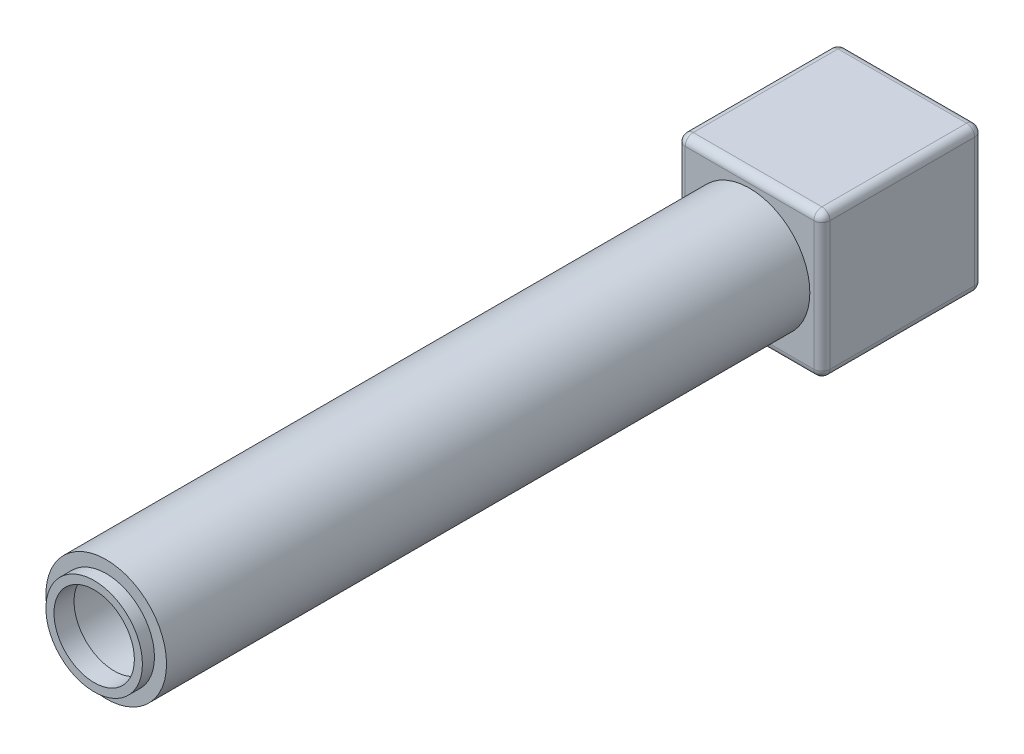
ISO-10303-21;
HEADER;
FILE_DESCRIPTION(('STEP AP214'),'2;1');
FILE_NAME('part.step','',(''),(''),'','','');
FILE_SCHEMA(('AUTOMOTIVE_DESIGN { 1 0 10303 214 1 1 1 1 }'));
ENDSEC;
DATA;
#1=APPLICATION_CONTEXT('core data for automotive mechanical design processes');
#2=APPLICATION_PROTOCOL_DEFINITION('international standard','automotive_design',2000,#1);
#3=PRODUCT_CONTEXT('',#1,'mechanical');
#4=PRODUCT('Part','Part','',(#3));
#5=PRODUCT_RELATED_PRODUCT_CATEGORY('part','',(#4));
#6=PRODUCT_DEFINITION_FORMATION('','',#4);
#7=PRODUCT_DEFINITION_CONTEXT('part definition',#1,'design');
#8=PRODUCT_DEFINITION('design','',#6,#7);
#9=PRODUCT_DEFINITION_SHAPE('','',#8);
#10=(LENGTH_UNIT() NAMED_UNIT(*) SI_UNIT(.MILLI.,.METRE.));
#11=(NAMED_UNIT(*) PLANE_ANGLE_UNIT() SI_UNIT($,.RADIAN.));
#12=(NAMED_UNIT(*) SI_UNIT($,.STERADIAN.) SOLID_ANGLE_UNIT());
#13=UNCERTAINTY_MEASURE_WITH_UNIT(LENGTH_MEASURE(1.E-05),#10,'distance_accuracy_value','');
#14=(GEOMETRIC_REPRESENTATION_CONTEXT(3) GLOBAL_UNCERTAINTY_ASSIGNED_CONTEXT((#13)) GLOBAL_UNIT_ASSIGNED_CONTEXT((#10,
#11,#12)) REPRESENTATION_CONTEXT('',''));
#15=CARTESIAN_POINT('',(0.,0.,0.));
#16=DIRECTION('',(0.,0.,1.));
#17=DIRECTION('',(1.,0.,0.));
#18=AXIS2_PLACEMENT_3D('',#15,#16,#17);
#19=CARTESIAN_POINT('',(0.,0.,79.));
#20=DIRECTION('',(0.,0.,1.));
#21=DIRECTION('',(1.,0.,0.));
#22=AXIS2_PLACEMENT_3D('',#19,#20,#21);
#23=CYLINDRICAL_SURFACE('',#22,6.);
#24=CARTESIAN_POINT('',(0.,0.,79.));
#25=DIRECTION('',(0.,0.,1.));
#26=DIRECTION('',(1.,0.,0.));
#27=AXIS2_PLACEMENT_3D('',#24,#25,#26);
#28=CIRCLE('',#27,6.);
#29=CARTESIAN_POINT('',(6.,0.,79.));
#30=VERTEX_POINT('',#29);
#31=EDGE_CURVE('E11',#30,#30,#28,.T.);
#32=ORIENTED_EDGE('',*,*,#31,.T.);
#33=EDGE_LOOP('',(#32));
#34=FACE_BOUND('',#33,.T.);
#35=CARTESIAN_POINT('',(0.,0.,81.5));
#36=DIRECTION('',(0.,0.,1.));
#37=DIRECTION('',(1.,0.,0.));
#38=AXIS2_PLACEMENT_3D('',#35,#36,#37);
#39=CIRCLE('',#38,6.);
#40=CARTESIAN_POINT('',(6.,0.,81.5));
#41=VERTEX_POINT('',#40);
#42=EDGE_CURVE('E58',#41,#41,#39,.T.);
#43=ORIENTED_EDGE('',*,*,#42,.F.);
#44=EDGE_LOOP('',(#43));
#45=FACE_BOUND('',#44,.T.);
#46=ADVANCED_FACE('F48',(#34,#45),#23,.T.);
#47=CARTESIAN_POINT('',(0.,0.,79.));
#48=DIRECTION('',(0.,0.,1.));
#49=DIRECTION('',(1.,0.,0.));
#50=AXIS2_PLACEMENT_3D('',#47,#48,#49);
#51=PLANE('',#50);
#52=CARTESIAN_POINT('',(0.,0.,79.));
#53=DIRECTION('',(0.,0.,1.));
#54=DIRECTION('',(1.,0.,0.));
#55=AXIS2_PLACEMENT_3D('',#52,#53,#54);
#56=CIRCLE('',#55,5.);
#57=CARTESIAN_POINT('',(5.,0.,79.));
#58=VERTEX_POINT('',#57);
#59=EDGE_CURVE('E54',#58,#58,#56,.T.);
#60=ORIENTED_EDGE('',*,*,#59,.T.);
#61=EDGE_LOOP('',(#60));
#62=FACE_BOUND('',#61,.T.);
#63=ORIENTED_EDGE('',*,*,#31,.F.);
#64=EDGE_LOOP('',(#63));
#65=FACE_BOUND('',#64,.T.);
#66=ADVANCED_FACE('F77',(#62,#65),#51,.F.);
#67=CARTESIAN_POINT('',(0.,0.,79.));
#68=DIRECTION('',(0.,0.,1.));
#69=DIRECTION('',(1.,0.,0.));
#70=AXIS2_PLACEMENT_3D('',#67,#68,#69);
#71=CYLINDRICAL_SURFACE('',#70,5.);
#72=ORIENTED_EDGE('',*,*,#59,.F.);
#73=EDGE_LOOP('',(#72));
#74=FACE_BOUND('',#73,.T.);
#75=CARTESIAN_POINT('',(0.,0.,81.5));
#76=DIRECTION('',(0.,0.,1.));
#77=DIRECTION('',(1.,0.,0.));
#78=AXIS2_PLACEMENT_3D('',#75,#76,#77);
#79=CIRCLE('',#78,5.);
#80=CARTESIAN_POINT('',(5.,0.,81.5));
#81=VERTEX_POINT('',#80);
#82=EDGE_CURVE('E62',#81,#81,#79,.T.);
#83=ORIENTED_EDGE('',*,*,#82,.T.);
#84=EDGE_LOOP('',(#83));
#85=FACE_BOUND('',#84,.T.);
#86=ADVANCED_FACE('F68',(#74,#85),#71,.F.);
#87=CARTESIAN_POINT('',(0.,0.,81.5));
#88=DIRECTION('',(0.,0.,1.));
#89=DIRECTION('',(1.,0.,0.));
#90=AXIS2_PLACEMENT_3D('',#87,#88,#89);
#91=PLANE('',#90);
#92=ORIENTED_EDGE('',*,*,#42,.T.);
#93=EDGE_LOOP('',(#92));
#94=FACE_BOUND('',#93,.T.);
#95=ORIENTED_EDGE('',*,*,#82,.F.);
#96=EDGE_LOOP('',(#95));
#97=FACE_BOUND('',#96,.T.);
#98=ADVANCED_FACE('F70',(#94,#97),#91,.T.);
#99=CLOSED_SHELL('',(#46,#66,#86,#98));
#100=MANIFOLD_SOLID_BREP('B2',#99);
#101=CARTESIAN_POINT('',(-7.5,-7.5,-18.5));
#102=DIRECTION('',(0.,-1.,0.));
#103=DIRECTION('',(0.,0.,-1.));
#104=AXIS2_PLACEMENT_3D('',#101,#102,#103);
#105=PLANE('',#104);
#106=DIRECTION('',(0.,0.,1.));
#107=VECTOR('',#106,1.);
#108=CARTESIAN_POINT('',(7.5,-7.5,-18.5));
#109=LINE('',#108,#107);
#110=CARTESIAN_POINT('',(7.5,-7.5,-10.));
#111=VERTEX_POINT('',#110);
#112=CARTESIAN_POINT('',(7.5,-7.5,-1.5));
#113=VERTEX_POINT('',#112);
#114=EDGE_CURVE('E251',#111,#113,#109,.T.);
#115=ORIENTED_EDGE('',*,*,#114,.F.);
#116=CARTESIAN_POINT('',(0.,-7.5,-10.));
#117=DIRECTION('',(0.,-1.,0.));
#118=DIRECTION('',(0.,0.,-1.));
#119=AXIS2_PLACEMENT_3D('',#116,#117,#118);
#120=CIRCLE('',#119,7.5);
#121=CARTESIAN_POINT('',(-7.5,-7.5,-10.));
#122=VERTEX_POINT('',#121);
#123=EDGE_CURVE('E240',#111,#122,#120,.T.);
#124=ORIENTED_EDGE('',*,*,#123,.T.);
#125=DIRECTION('',(0.,0.,1.));
#126=VECTOR('',#125,1.);
#127=CARTESIAN_POINT('',(-7.5,-7.5,-18.5));
#128=LINE('',#127,#126);
#129=CARTESIAN_POINT('',(-7.5,-7.5,-1.5));
#130=VERTEX_POINT('',#129);
#131=EDGE_CURVE('E249',#122,#130,#128,.T.);
#132=ORIENTED_EDGE('',*,*,#131,.T.);
#133=DIRECTION('',(1.,0.,0.));
#134=VECTOR('',#133,1.);
#135=CARTESIAN_POINT('',(-7.5,-7.5,-1.5));
#136=LINE('',#135,#134);
#137=EDGE_CURVE('E416',#130,#113,#136,.T.);
#138=ORIENTED_EDGE('',*,*,#137,.T.);
#139=EDGE_LOOP('',(#115,#124,#132,#138));
#140=FACE_BOUND('',#139,.T.);
#141=ADVANCED_FACE('F118',(#140),#105,.F.);
#142=CARTESIAN_POINT('',(7.5,7.5,-18.5));
#143=DIRECTION('',(1.,0.,0.));
#144=DIRECTION('',(0.,1.,0.));
#145=AXIS2_PLACEMENT_3D('',#142,#143,#144);
#146=PLANE('',#145);
#147=DIRECTION('',(0.,1.,0.));
#148=VECTOR('',#147,1.);
#149=CARTESIAN_POINT('',(7.5,7.5,-1.5));
#150=LINE('',#149,#148);
#151=CARTESIAN_POINT('',(7.5,7.5,-1.5));
#152=VERTEX_POINT('',#151);
#153=EDGE_CURVE('E253',#113,#152,#150,.T.);
#154=ORIENTED_EDGE('',*,*,#153,.T.);
#155=DIRECTION('',(0.,0.,1.));
#156=VECTOR('',#155,1.);
#157=CARTESIAN_POINT('',(7.5,7.5,-18.5));
#158=LINE('',#157,#156);
#159=CARTESIAN_POINT('',(7.5,7.5,-18.5));
#160=VERTEX_POINT('',#159);
#161=EDGE_CURVE('E273',#160,#152,#158,.T.);
#162=ORIENTED_EDGE('',*,*,#161,.F.);
#163=DIRECTION('',(0.,1.,0.));
#164=VECTOR('',#163,1.);
#165=CARTESIAN_POINT('',(7.5,7.5,-18.5));
#166=LINE('',#165,#164);
#167=CARTESIAN_POINT('',(7.5,-7.5,-18.5));
#168=VERTEX_POINT('',#167);
#169=EDGE_CURVE('E412',#168,#160,#166,.T.);
#170=ORIENTED_EDGE('',*,*,#169,.F.);
#171=EDGE_CURVE('E268',#168,#111,#109,.T.);
#172=ORIENTED_EDGE('',*,*,#171,.T.);
#173=ORIENTED_EDGE('',*,*,#114,.T.);
#174=EDGE_LOOP('',(#154,#162,#170,#172,#173));
#175=FACE_BOUND('',#174,.T.);
#176=ADVANCED_FACE('F432',(#175),#146,.F.);
#177=CARTESIAN_POINT('',(-7.5,-7.5,-18.5));
#178=VERTEX_POINT('',#177);
#179=EDGE_CURVE('E257',#178,#122,#128,.T.);
#180=ORIENTED_EDGE('',*,*,#179,.T.);
#181=EDGE_CURVE('E236',#122,#111,#120,.T.);
#182=ORIENTED_EDGE('',*,*,#181,.T.);
#183=ORIENTED_EDGE('',*,*,#171,.F.);
#184=DIRECTION('',(1.,0.,0.));
#185=VECTOR('',#184,1.);
#186=CARTESIAN_POINT('',(-7.5,-7.5,-18.5));
#187=LINE('',#186,#185);
#188=EDGE_CURVE('E267',#178,#168,#187,.T.);
#189=ORIENTED_EDGE('',*,*,#188,.F.);
#190=EDGE_LOOP('',(#180,#182,#183,#189));
#191=FACE_BOUND('',#190,.T.);
#192=ADVANCED_FACE('F265',(#191),#105,.F.);
#193=CARTESIAN_POINT('',(-7.5,7.5,-18.5));
#194=DIRECTION('',(-1.,0.,0.));
#195=DIRECTION('',(0.,-1.,0.));
#196=AXIS2_PLACEMENT_3D('',#193,#194,#195);
#197=PLANE('',#196);
#198=DIRECTION('',(0.,-1.,0.));
#199=VECTOR('',#198,1.);
#200=CARTESIAN_POINT('',(-7.5,7.5,-1.5));
#201=LINE('',#200,#199);
#202=CARTESIAN_POINT('',(-7.5,7.5,-1.5));
#203=VERTEX_POINT('',#202);
#204=EDGE_CURVE('E260',#203,#130,#201,.T.);
#205=ORIENTED_EDGE('',*,*,#204,.T.);
#206=ORIENTED_EDGE('',*,*,#131,.F.);
#207=ORIENTED_EDGE('',*,*,#179,.F.);
#208=DIRECTION('',(0.,-1.,0.));
#209=VECTOR('',#208,1.);
#210=CARTESIAN_POINT('',(-7.5,7.5,-18.5));
#211=LINE('',#210,#209);
#212=CARTESIAN_POINT('',(-7.5,7.5,-18.5));
#213=VERTEX_POINT('',#212);
#214=EDGE_CURVE('E419',#213,#178,#211,.T.);
#215=ORIENTED_EDGE('',*,*,#214,.F.);
#216=DIRECTION('',(0.,0.,1.));
#217=VECTOR('',#216,1.);
#218=CARTESIAN_POINT('',(-7.5,7.5,-18.5));
#219=LINE('',#218,#217);
#220=EDGE_CURVE('E262',#213,#203,#219,.T.);
#221=ORIENTED_EDGE('',*,*,#220,.T.);
#222=EDGE_LOOP('',(#205,#206,#207,#215,#221));
#223=FACE_BOUND('',#222,.T.);
#224=ADVANCED_FACE('F255',(#223),#197,.F.);
#225=CARTESIAN_POINT('',(-7.5,7.5,-18.5));
#226=DIRECTION('',(0.,1.,0.));
#227=DIRECTION('',(0.,0.,1.));
#228=AXIS2_PLACEMENT_3D('',#225,#226,#227);
#229=PLANE('',#228);
#230=DIRECTION('',(-1.,0.,0.));
#231=VECTOR('',#230,1.);
#232=CARTESIAN_POINT('',(-7.5,7.5,-1.5));
#233=LINE('',#232,#231);
#234=EDGE_CURVE('E424',#152,#203,#233,.T.);
#235=ORIENTED_EDGE('',*,*,#234,.T.);
#236=ORIENTED_EDGE('',*,*,#220,.F.);
#237=DIRECTION('',(-1.,0.,0.));
#238=VECTOR('',#237,1.);
#239=CARTESIAN_POINT('',(-7.5,7.5,-18.5));
#240=LINE('',#239,#238);
#241=EDGE_CURVE('E415',#160,#213,#240,.T.);
#242=ORIENTED_EDGE('',*,*,#241,.F.);
#243=ORIENTED_EDGE('',*,*,#161,.T.);
#244=EDGE_LOOP('',(#235,#236,#242,#243));
#245=FACE_BOUND('',#244,.T.);
#246=ADVANCED_FACE('F438',(#245),#229,.F.);
#247=CARTESIAN_POINT('',(0.,0.,-18.5));
#248=DIRECTION('',(0.,0.,1.));
#249=DIRECTION('',(1.,0.,0.));
#250=AXIS2_PLACEMENT_3D('',#247,#248,#249);
#251=PLANE('',#250);
#252=ORIENTED_EDGE('',*,*,#169,.T.);
#253=ORIENTED_EDGE('',*,*,#241,.T.);
#254=ORIENTED_EDGE('',*,*,#214,.T.);
#255=ORIENTED_EDGE('',*,*,#188,.T.);
#256=EDGE_LOOP('',(#252,#253,#254,#255));
#257=FACE_BOUND('',#256,.T.);
#258=ADVANCED_FACE('F436',(#257),#251,.T.);
#259=CARTESIAN_POINT('',(0.,0.,-1.5));
#260=DIRECTION('',(0.,0.,1.));
#261=DIRECTION('',(1.,0.,0.));
#262=AXIS2_PLACEMENT_3D('',#259,#260,#261);
#263=PLANE('',#262);
#264=CARTESIAN_POINT('',(0.,0.,-1.5));
#265=DIRECTION('',(0.,0.,-1.));
#266=DIRECTION('',(-1.,0.,0.));
#267=AXIS2_PLACEMENT_3D('',#264,#265,#266);
#268=CIRCLE('',#267,6.);
#269=CARTESIAN_POINT('',(-6.,0.,-1.5));
#270=VERTEX_POINT('',#269);
#271=EDGE_CURVE('E400',#270,#270,#268,.T.);
#272=ORIENTED_EDGE('',*,*,#271,.F.);
#273=EDGE_LOOP('',(#272));
#274=FACE_BOUND('',#273,.T.);
#275=ORIENTED_EDGE('',*,*,#153,.F.);
#276=ORIENTED_EDGE('',*,*,#137,.F.);
#277=ORIENTED_EDGE('',*,*,#204,.F.);
#278=ORIENTED_EDGE('',*,*,#234,.F.);
#279=EDGE_LOOP('',(#275,#276,#277,#278));
#280=FACE_BOUND('',#279,.T.);
#281=ADVANCED_FACE('F429',(#274,#280),#263,.F.);
#282=CARTESIAN_POINT('',(0.,-7.5,-10.));
#283=DIRECTION('',(0.,-1.,0.));
#284=DIRECTION('',(0.,0.,-1.));
#285=AXIS2_PLACEMENT_3D('',#282,#283,#284);
#286=CYLINDRICAL_SURFACE('',#285,7.5);
#287=ORIENTED_EDGE('',*,*,#123,.F.);
#288=ORIENTED_EDGE('',*,*,#181,.F.);
#289=EDGE_LOOP('',(#287,#288));
#290=FACE_BOUND('',#289,.T.);
#291=CARTESIAN_POINT('',(0.,-9.,-10.));
#292=DIRECTION('',(0.,-1.,0.));
#293=DIRECTION('',(0.,0.,-1.));
#294=AXIS2_PLACEMENT_3D('',#291,#292,#293);
#295=CIRCLE('',#294,7.5);
#296=CARTESIAN_POINT('',(0.,-9.,-17.5));
#297=VERTEX_POINT('',#296);
#298=EDGE_CURVE('E244',#297,#297,#295,.T.);
#299=ORIENTED_EDGE('',*,*,#298,.T.);
#300=EDGE_LOOP('',(#299));
#301=FACE_BOUND('',#300,.T.);
#302=ADVANCED_FACE('F238',(#290,#301),#286,.F.);
#303=CARTESIAN_POINT('',(0.,0.,80.));
#304=DIRECTION('',(0.,0.,-1.));
#305=DIRECTION('',(-1.,0.,0.));
#306=AXIS2_PLACEMENT_3D('',#303,#304,#305);
#307=CYLINDRICAL_SURFACE('',#306,7.5);
#308=CARTESIAN_POINT('',(0.,0.,80.));
#309=DIRECTION('',(0.,0.,1.));
#310=DIRECTION('',(1.,0.,0.));
#311=AXIS2_PLACEMENT_3D('',#308,#309,#310);
#312=CIRCLE('',#311,7.5);
#313=CARTESIAN_POINT('',(7.5,0.,80.));
#314=VERTEX_POINT('',#313);
#315=EDGE_CURVE('E278',#314,#314,#312,.T.);
#316=ORIENTED_EDGE('',*,*,#315,.F.);
#317=EDGE_LOOP('',(#316));
#318=FACE_BOUND('',#317,.T.);
#319=CARTESIAN_POINT('',(0.,0.,0.));
#320=DIRECTION('',(0.,0.,1.));
#321=DIRECTION('',(1.,0.,0.));
#322=AXIS2_PLACEMENT_3D('',#319,#320,#321);
#323=CIRCLE('',#322,7.5);
#324=CARTESIAN_POINT('',(7.5,0.,0.));
#325=VERTEX_POINT('',#324);
#326=EDGE_CURVE('E279',#325,#325,#323,.T.);
#327=ORIENTED_EDGE('',*,*,#326,.T.);
#328=EDGE_LOOP('',(#327));
#329=FACE_BOUND('',#328,.T.);
#330=ADVANCED_FACE('F474',(#318,#329),#307,.T.);
#331=CARTESIAN_POINT('',(0.,0.,80.));
#332=DIRECTION('',(0.,0.,1.));
#333=DIRECTION('',(1.,0.,0.));
#334=AXIS2_PLACEMENT_3D('',#331,#332,#333);
#335=PLANE('',#334);
#336=CARTESIAN_POINT('',(0.,0.,80.));
#337=DIRECTION('',(0.,0.,1.));
#338=DIRECTION('',(1.,0.,0.));
#339=AXIS2_PLACEMENT_3D('',#336,#337,#338);
#340=CIRCLE('',#339,6.);
#341=CARTESIAN_POINT('',(6.,0.,80.));
#342=VERTEX_POINT('',#341);
#343=EDGE_CURVE('E275',#342,#342,#340,.T.);
#344=ORIENTED_EDGE('',*,*,#343,.F.);
#345=EDGE_LOOP('',(#344));
#346=FACE_BOUND('',#345,.T.);
#347=ORIENTED_EDGE('',*,*,#315,.T.);
#348=EDGE_LOOP('',(#347));
#349=FACE_BOUND('',#348,.T.);
#350=ADVANCED_FACE('F498',(#346,#349),#335,.T.);
#351=CARTESIAN_POINT('',(0.,0.,80.));
#352=DIRECTION('',(0.,0.,-1.));
#353=DIRECTION('',(-1.,0.,0.));
#354=AXIS2_PLACEMENT_3D('',#351,#352,#353);
#355=CYLINDRICAL_SURFACE('',#354,6.);
#356=ORIENTED_EDGE('',*,*,#271,.T.);
#357=EDGE_LOOP('',(#356));
#358=FACE_BOUND('',#357,.T.);
#359=ORIENTED_EDGE('',*,*,#343,.T.);
#360=EDGE_LOOP('',(#359));
#361=FACE_BOUND('',#360,.T.);
#362=ADVANCED_FACE('F493',(#358,#361),#355,.F.);
#363=CARTESIAN_POINT('',(0.,0.,0.));
#364=DIRECTION('',(0.,0.,-1.));
#365=DIRECTION('',(-1.,0.,0.));
#366=AXIS2_PLACEMENT_3D('',#363,#364,#365);
#367=PLANE('',#366);
#368=DIRECTION('',(1.,0.,0.));
#369=VECTOR('',#368,1.);
#370=CARTESIAN_POINT('',(9.,-8.,0.));
#371=LINE('',#370,#369);
#372=CARTESIAN_POINT('',(-8.,-8.,0.));
#373=VERTEX_POINT('',#372);
#374=CARTESIAN_POINT('',(8.,-8.,0.));
#375=VERTEX_POINT('',#374);
#376=EDGE_CURVE('E311',#373,#375,#371,.T.);
#377=ORIENTED_EDGE('',*,*,#376,.T.);
#378=DIRECTION('',(0.,1.,0.));
#379=VECTOR('',#378,1.);
#380=CARTESIAN_POINT('',(8.,9.,0.));
#381=LINE('',#380,#379);
#382=CARTESIAN_POINT('',(8.,8.,0.));
#383=VERTEX_POINT('',#382);
#384=EDGE_CURVE('E317',#375,#383,#381,.T.);
#385=ORIENTED_EDGE('',*,*,#384,.T.);
#386=DIRECTION('',(-1.,0.,0.));
#387=VECTOR('',#386,1.);
#388=CARTESIAN_POINT('',(-9.,8.,0.));
#389=LINE('',#388,#387);
#390=CARTESIAN_POINT('',(-8.,8.,0.));
#391=VERTEX_POINT('',#390);
#392=EDGE_CURVE('E315',#383,#391,#389,.T.);
#393=ORIENTED_EDGE('',*,*,#392,.T.);
#394=DIRECTION('',(0.,-1.,0.));
#395=VECTOR('',#394,1.);
#396=CARTESIAN_POINT('',(-8.,-9.,0.));
#397=LINE('',#396,#395);
#398=EDGE_CURVE('E313',#391,#373,#397,.T.);
#399=ORIENTED_EDGE('',*,*,#398,.T.);
#400=EDGE_LOOP('',(#377,#385,#393,#399));
#401=FACE_BOUND('',#400,.T.);
#402=ORIENTED_EDGE('',*,*,#326,.F.);
#403=EDGE_LOOP('',(#402));
#404=FACE_BOUND('',#403,.T.);
#405=ADVANCED_FACE('F497',(#401,#404),#367,.F.);
#406=CARTESIAN_POINT('',(0.,0.,-20.));
#407=DIRECTION('',(0.,0.,-1.));
#408=DIRECTION('',(-1.,0.,0.));
#409=AXIS2_PLACEMENT_3D('',#406,#407,#408);
#410=PLANE('',#409);
#411=DIRECTION('',(0.,1.,0.));
#412=VECTOR('',#411,1.);
#413=CARTESIAN_POINT('',(8.,0.,-20.));
#414=LINE('',#413,#412);
#415=CARTESIAN_POINT('',(8.,8.,-20.));
#416=VERTEX_POINT('',#415);
#417=CARTESIAN_POINT('',(8.,-8.,-20.));
#418=VERTEX_POINT('',#417);
#419=EDGE_CURVE('E297',#416,#418,#414,.F.);
#420=ORIENTED_EDGE('',*,*,#419,.T.);
#421=DIRECTION('',(1.,0.,0.));
#422=VECTOR('',#421,1.);
#423=CARTESIAN_POINT('',(0.,-8.,-20.));
#424=LINE('',#423,#422);
#425=CARTESIAN_POINT('',(-8.,-8.,-20.));
#426=VERTEX_POINT('',#425);
#427=EDGE_CURVE('E299',#418,#426,#424,.F.);
#428=ORIENTED_EDGE('',*,*,#427,.T.);
#429=DIRECTION('',(0.,-1.,0.));
#430=VECTOR('',#429,1.);
#431=CARTESIAN_POINT('',(-8.,0.,-20.));
#432=LINE('',#431,#430);
#433=CARTESIAN_POINT('',(-8.,8.,-20.));
#434=VERTEX_POINT('',#433);
#435=EDGE_CURVE('E293',#426,#434,#432,.F.);
#436=ORIENTED_EDGE('',*,*,#435,.T.);
#437=DIRECTION('',(-1.,0.,0.));
#438=VECTOR('',#437,1.);
#439=CARTESIAN_POINT('',(0.,8.,-20.));
#440=LINE('',#439,#438);
#441=EDGE_CURVE('E295',#434,#416,#440,.F.);
#442=ORIENTED_EDGE('',*,*,#441,.T.);
#443=EDGE_LOOP('',(#420,#428,#436,#442));
#444=FACE_BOUND('',#443,.T.);
#445=ADVANCED_FACE('F510',(#444),#410,.T.);
#446=CARTESIAN_POINT('',(-9.,9.,-20.));
#447=DIRECTION('',(0.,1.,0.));
#448=DIRECTION('',(0.,0.,1.));
#449=AXIS2_PLACEMENT_3D('',#446,#447,#448);
#450=PLANE('',#449);
#451=DIRECTION('',(0.,0.,1.));
#452=VECTOR('',#451,1.);
#453=CARTESIAN_POINT('',(8.,9.,-20.));
#454=LINE('',#453,#452);
#455=CARTESIAN_POINT('',(8.,9.,-1.));
#456=VERTEX_POINT('',#455);
#457=CARTESIAN_POINT('',(8.,9.,-19.));
#458=VERTEX_POINT('',#457);
#459=EDGE_CURVE('E324',#456,#458,#454,.F.);
#460=ORIENTED_EDGE('',*,*,#459,.T.);
#461=DIRECTION('',(-1.,0.,0.));
#462=VECTOR('',#461,1.);
#463=CARTESIAN_POINT('',(-9.,9.,-19.));
#464=LINE('',#463,#462);
#465=CARTESIAN_POINT('',(-8.,9.,-19.));
#466=VERTEX_POINT('',#465);
#467=EDGE_CURVE('E326',#458,#466,#464,.T.);
#468=ORIENTED_EDGE('',*,*,#467,.T.);
#469=DIRECTION('',(0.,0.,1.));
#470=VECTOR('',#469,1.);
#471=CARTESIAN_POINT('',(-8.,9.,-20.));
#472=LINE('',#471,#470);
#473=CARTESIAN_POINT('',(-8.,9.,-1.));
#474=VERTEX_POINT('',#473);
#475=EDGE_CURVE('E320',#466,#474,#472,.T.);
#476=ORIENTED_EDGE('',*,*,#475,.T.);
#477=DIRECTION('',(-1.,0.,0.));
#478=VECTOR('',#477,1.);
#479=CARTESIAN_POINT('',(9.,9.,-1.));
#480=LINE('',#479,#478);
#481=EDGE_CURVE('E322',#474,#456,#480,.F.);
#482=ORIENTED_EDGE('',*,*,#481,.T.);
#483=EDGE_LOOP('',(#460,#468,#476,#482));
#484=FACE_BOUND('',#483,.T.);
#485=ADVANCED_FACE('F521',(#484),#450,.T.);
#486=CARTESIAN_POINT('',(-9.,-9.,-20.));
#487=DIRECTION('',(-1.,0.,0.));
#488=DIRECTION('',(0.,0.,1.));
#489=AXIS2_PLACEMENT_3D('',#486,#487,#488);
#490=PLANE('',#489);
#491=DIRECTION('',(0.,-1.,0.));
#492=VECTOR('',#491,1.);
#493=CARTESIAN_POINT('',(-9.,-9.,-19.));
#494=LINE('',#493,#492);
#495=CARTESIAN_POINT('',(-9.,8.,-19.));
#496=VERTEX_POINT('',#495);
#497=CARTESIAN_POINT('',(-9.,-8.,-19.));
#498=VERTEX_POINT('',#497);
#499=EDGE_CURVE('E127',#496,#498,#494,.T.);
#500=ORIENTED_EDGE('',*,*,#499,.T.);
#501=DIRECTION('',(0.,0.,1.));
#502=VECTOR('',#501,1.);
#503=CARTESIAN_POINT('',(-9.,-8.,-20.));
#504=LINE('',#503,#502);
#505=CARTESIAN_POINT('',(-9.,-8.,-1.));
#506=VERTEX_POINT('',#505);
#507=EDGE_CURVE('E46',#498,#506,#504,.T.);
#508=ORIENTED_EDGE('',*,*,#507,.T.);
#509=DIRECTION('',(0.,-1.,0.));
#510=VECTOR('',#509,1.);
#511=CARTESIAN_POINT('',(-9.,9.,-1.));
#512=LINE('',#511,#510);
#513=CARTESIAN_POINT('',(-9.,8.,-1.));
#514=VERTEX_POINT('',#513);
#515=EDGE_CURVE('E329',#506,#514,#512,.F.);
#516=ORIENTED_EDGE('',*,*,#515,.T.);
#517=DIRECTION('',(0.,0.,1.));
#518=VECTOR('',#517,1.);
#519=CARTESIAN_POINT('',(-9.,7.99999999999999,-20.));
#520=LINE('',#519,#518);
#521=EDGE_CURVE('E138',#514,#496,#520,.F.);
#522=ORIENTED_EDGE('',*,*,#521,.T.);
#523=EDGE_LOOP('',(#500,#508,#516,#522));
#524=FACE_BOUND('',#523,.T.);
#525=ADVANCED_FACE('F532',(#524),#490,.T.);
#526=CARTESIAN_POINT('',(-9.,-9.,-20.));
#527=DIRECTION('',(0.,-1.,0.));
#528=DIRECTION('',(0.,0.,-1.));
#529=AXIS2_PLACEMENT_3D('',#526,#527,#528);
#530=PLANE('',#529);
#531=DIRECTION('',(0.,0.,1.));
#532=VECTOR('',#531,1.);
#533=CARTESIAN_POINT('',(-8.,-9.,-20.));
#534=LINE('',#533,#532);
#535=CARTESIAN_POINT('',(-8.,-9.,-1.));
#536=VERTEX_POINT('',#535);
#537=CARTESIAN_POINT('',(-8.,-9.,-19.));
#538=VERTEX_POINT('',#537);
#539=EDGE_CURVE('E286',#536,#538,#534,.F.);
#540=ORIENTED_EDGE('',*,*,#539,.T.);
#541=DIRECTION('',(1.,0.,0.));
#542=VECTOR('',#541,1.);
#543=CARTESIAN_POINT('',(-9.,-9.,-19.));
#544=LINE('',#543,#542);
#545=CARTESIAN_POINT('',(8.,-9.,-19.));
#546=VERTEX_POINT('',#545);
#547=EDGE_CURVE('E290',#538,#546,#544,.T.);
#548=ORIENTED_EDGE('',*,*,#547,.T.);
#549=DIRECTION('',(0.,0.,1.));
#550=VECTOR('',#549,1.);
#551=CARTESIAN_POINT('',(8.,-9.,-20.));
#552=LINE('',#551,#550);
#553=CARTESIAN_POINT('',(8.,-9.,-1.));
#554=VERTEX_POINT('',#553);
#555=EDGE_CURVE('E288',#546,#554,#552,.T.);
#556=ORIENTED_EDGE('',*,*,#555,.T.);
#557=DIRECTION('',(1.,0.,0.));
#558=VECTOR('',#557,1.);
#559=CARTESIAN_POINT('',(-9.,-9.,-1.));
#560=LINE('',#559,#558);
#561=EDGE_CURVE('E282',#554,#536,#560,.F.);
#562=ORIENTED_EDGE('',*,*,#561,.T.);
#563=EDGE_LOOP('',(#540,#548,#556,#562));
#564=FACE_BOUND('',#563,.T.);
#565=ORIENTED_EDGE('',*,*,#298,.F.);
#566=EDGE_LOOP('',(#565));
#567=FACE_BOUND('',#566,.T.);
#568=ADVANCED_FACE('F543',(#564,#567),#530,.T.);
#569=CARTESIAN_POINT('',(9.,-9.,-20.));
#570=DIRECTION('',(1.,0.,0.));
#571=DIRECTION('',(0.,0.,-1.));
#572=AXIS2_PLACEMENT_3D('',#569,#570,#571);
#573=PLANE('',#572);
#574=DIRECTION('',(0.,0.,1.));
#575=VECTOR('',#574,1.);
#576=CARTESIAN_POINT('',(9.,-8.,-20.));
#577=LINE('',#576,#575);
#578=CARTESIAN_POINT('',(9.,-8.,-1.));
#579=VERTEX_POINT('',#578);
#580=CARTESIAN_POINT('',(9.,-8.,-19.));
#581=VERTEX_POINT('',#580);
#582=EDGE_CURVE('E306',#579,#581,#577,.F.);
#583=ORIENTED_EDGE('',*,*,#582,.T.);
#584=DIRECTION('',(0.,1.,0.));
#585=VECTOR('',#584,1.);
#586=CARTESIAN_POINT('',(9.,-9.,-19.));
#587=LINE('',#586,#585);
#588=CARTESIAN_POINT('',(9.,7.99999999999999,-19.));
#589=VERTEX_POINT('',#588);
#590=EDGE_CURVE('E308',#581,#589,#587,.T.);
#591=ORIENTED_EDGE('',*,*,#590,.T.);
#592=DIRECTION('',(0.,0.,1.));
#593=VECTOR('',#592,1.);
#594=CARTESIAN_POINT('',(9.,7.99999999999999,-20.));
#595=LINE('',#594,#593);
#596=CARTESIAN_POINT('',(9.,7.99999999999999,-1.));
#597=VERTEX_POINT('',#596);
#598=EDGE_CURVE('E302',#589,#597,#595,.T.);
#599=ORIENTED_EDGE('',*,*,#598,.T.);
#600=DIRECTION('',(0.,1.,0.));
#601=VECTOR('',#600,1.);
#602=CARTESIAN_POINT('',(9.,-9.,-1.));
#603=LINE('',#602,#601);
#604=EDGE_CURVE('E304',#597,#579,#603,.F.);
#605=ORIENTED_EDGE('',*,*,#604,.T.);
#606=EDGE_LOOP('',(#583,#591,#599,#605));
#607=FACE_BOUND('',#606,.T.);
#608=ADVANCED_FACE('F553',(#607),#573,.T.);
#609=CARTESIAN_POINT('',(0.,8.,-1.));
#610=DIRECTION('',(1.,0.,0.));
#611=DIRECTION('',(0.,0.,-1.));
#612=AXIS2_PLACEMENT_3D('',#609,#610,#611);
#613=CYLINDRICAL_SURFACE('',#612,1.);
#614=CARTESIAN_POINT('',(-8.,8.,-1.));
#615=DIRECTION('',(-1.,0.,0.));
#616=DIRECTION('',(0.,0.,1.));
#617=AXIS2_PLACEMENT_3D('',#614,#615,#616);
#618=CIRCLE('',#617,1.);
#619=EDGE_CURVE('E122',#391,#474,#618,.T.);
#620=ORIENTED_EDGE('',*,*,#619,.F.);
#621=ORIENTED_EDGE('',*,*,#392,.F.);
#622=CARTESIAN_POINT('',(8.,8.,-1.));
#623=DIRECTION('',(1.,0.,0.));
#624=DIRECTION('',(0.,0.,-1.));
#625=AXIS2_PLACEMENT_3D('',#622,#623,#624);
#626=CIRCLE('',#625,1.);
#627=EDGE_CURVE('E392',#456,#383,#626,.T.);
#628=ORIENTED_EDGE('',*,*,#627,.F.);
#629=ORIENTED_EDGE('',*,*,#481,.F.);
#630=EDGE_LOOP('',(#620,#621,#628,#629));
#631=FACE_BOUND('',#630,.T.);
#632=ADVANCED_FACE('F120',(#631),#613,.T.);
#633=CARTESIAN_POINT('',(-8.,8.,-1.));
#634=DIRECTION('',(0.,1.,0.));
#635=DIRECTION('',(0.,0.,1.));
#636=AXIS2_PLACEMENT_3D('',#633,#634,#635);
#637=SPHERICAL_SURFACE('',#636,1.);
#638=CARTESIAN_POINT('',(-8.,8.,-1.));
#639=DIRECTION('',(0.,1.,0.));
#640=DIRECTION('',(0.,0.,1.));
#641=AXIS2_PLACEMENT_3D('',#638,#639,#640);
#642=CIRCLE('',#641,1.);
#643=EDGE_CURVE('E387',#391,#514,#642,.F.);
#644=ORIENTED_EDGE('',*,*,#643,.F.);
#645=ORIENTED_EDGE('',*,*,#619,.T.);
#646=CARTESIAN_POINT('',(-8.,8.,-1.));
#647=DIRECTION('',(0.,0.,1.));
#648=DIRECTION('',(1.,0.,0.));
#649=AXIS2_PLACEMENT_3D('',#646,#647,#648);
#650=CIRCLE('',#649,1.);
#651=EDGE_CURVE('E390',#514,#474,#650,.F.);
#652=ORIENTED_EDGE('',*,*,#651,.F.);
#653=EDGE_LOOP('',(#644,#645,#652));
#654=FACE_BOUND('',#653,.T.);
#655=ADVANCED_FACE('F574',(#654),#637,.T.);
#656=CARTESIAN_POINT('',(8.,8.,-1.));
#657=DIRECTION('',(0.,0.,1.));
#658=DIRECTION('',(1.,0.,0.));
#659=AXIS2_PLACEMENT_3D('',#656,#657,#658);
#660=SPHERICAL_SURFACE('',#659,1.);
#661=CARTESIAN_POINT('',(8.,7.99999999999999,-1.));
#662=DIRECTION('',(0.,0.,1.));
#663=DIRECTION('',(1.,0.,0.));
#664=AXIS2_PLACEMENT_3D('',#661,#662,#663);
#665=CIRCLE('',#664,1.);
#666=EDGE_CURVE('E382',#456,#597,#665,.F.);
#667=ORIENTED_EDGE('',*,*,#666,.F.);
#668=ORIENTED_EDGE('',*,*,#627,.T.);
#669=CARTESIAN_POINT('',(8.,8.,-1.));
#670=DIRECTION('',(0.,1.,0.));
#671=DIRECTION('',(-1.,0.,0.));
#672=AXIS2_PLACEMENT_3D('',#669,#670,#671);
#673=CIRCLE('',#672,1.);
#674=EDGE_CURVE('E385',#597,#383,#673,.F.);
#675=ORIENTED_EDGE('',*,*,#674,.F.);
#676=EDGE_LOOP('',(#667,#668,#675));
#677=FACE_BOUND('',#676,.T.);
#678=ADVANCED_FACE('F584',(#677),#660,.T.);
#679=CARTESIAN_POINT('',(-8.,8.,-20.));
#680=DIRECTION('',(0.,0.,1.));
#681=DIRECTION('',(1.,0.,0.));
#682=AXIS2_PLACEMENT_3D('',#679,#680,#681);
#683=CYLINDRICAL_SURFACE('',#682,1.);
#684=ORIENTED_EDGE('',*,*,#651,.T.);
#685=ORIENTED_EDGE('',*,*,#475,.F.);
#686=CARTESIAN_POINT('',(-8.,8.,-19.));
#687=DIRECTION('',(0.,0.,-1.));
#688=DIRECTION('',(-1.,0.,0.));
#689=AXIS2_PLACEMENT_3D('',#686,#687,#688);
#690=CIRCLE('',#689,1.);
#691=EDGE_CURVE('E377',#496,#466,#690,.T.);
#692=ORIENTED_EDGE('',*,*,#691,.F.);
#693=ORIENTED_EDGE('',*,*,#521,.F.);
#694=EDGE_LOOP('',(#684,#685,#692,#693));
#695=FACE_BOUND('',#694,.T.);
#696=ADVANCED_FACE('F593',(#695),#683,.T.);
#697=CARTESIAN_POINT('',(-8.,0.,-1.));
#698=DIRECTION('',(0.,1.,0.));
#699=DIRECTION('',(0.,0.,1.));
#700=AXIS2_PLACEMENT_3D('',#697,#698,#699);
#701=CYLINDRICAL_SURFACE('',#700,1.);
#702=ORIENTED_EDGE('',*,*,#643,.T.);
#703=ORIENTED_EDGE('',*,*,#515,.F.);
#704=CARTESIAN_POINT('',(-8.,-8.,-1.));
#705=DIRECTION('',(0.,-1.,0.));
#706=DIRECTION('',(0.,0.,-1.));
#707=AXIS2_PLACEMENT_3D('',#704,#705,#706);
#708=CIRCLE('',#707,1.);
#709=EDGE_CURVE('E374',#373,#506,#708,.T.);
#710=ORIENTED_EDGE('',*,*,#709,.F.);
#711=ORIENTED_EDGE('',*,*,#398,.F.);
#712=EDGE_LOOP('',(#702,#703,#710,#711));
#713=FACE_BOUND('',#712,.T.);
#714=ADVANCED_FACE('F603',(#713),#701,.T.);
#715=CARTESIAN_POINT('',(0.,-8.,-1.));
#716=DIRECTION('',(-1.,0.,0.));
#717=DIRECTION('',(0.,0.,1.));
#718=AXIS2_PLACEMENT_3D('',#715,#716,#717);
#719=CYLINDRICAL_SURFACE('',#718,1.);
#720=CARTESIAN_POINT('',(8.,-8.,-1.));
#721=DIRECTION('',(1.,0.,0.));
#722=DIRECTION('',(0.,0.,-1.));
#723=AXIS2_PLACEMENT_3D('',#720,#721,#722);
#724=CIRCLE('',#723,1.);
#725=EDGE_CURVE('E368',#375,#554,#724,.T.);
#726=ORIENTED_EDGE('',*,*,#725,.F.);
#727=ORIENTED_EDGE('',*,*,#376,.F.);
#728=CARTESIAN_POINT('',(-8.,-8.,-1.));
#729=DIRECTION('',(-1.,0.,0.));
#730=DIRECTION('',(0.,0.,1.));
#731=AXIS2_PLACEMENT_3D('',#728,#729,#730);
#732=CIRCLE('',#731,1.);
#733=EDGE_CURVE('E371',#536,#373,#732,.T.);
#734=ORIENTED_EDGE('',*,*,#733,.F.);
#735=ORIENTED_EDGE('',*,*,#561,.F.);
#736=EDGE_LOOP('',(#726,#727,#734,#735));
#737=FACE_BOUND('',#736,.T.);
#738=ADVANCED_FACE('F614',(#737),#719,.T.);
#739=CARTESIAN_POINT('',(8.,0.,-1.));
#740=DIRECTION('',(0.,-1.,0.));
#741=DIRECTION('',(0.,0.,-1.));
#742=AXIS2_PLACEMENT_3D('',#739,#740,#741);
#743=CYLINDRICAL_SURFACE('',#742,1.);
#744=ORIENTED_EDGE('',*,*,#674,.T.);
#745=ORIENTED_EDGE('',*,*,#384,.F.);
#746=CARTESIAN_POINT('',(8.,-8.,-1.));
#747=DIRECTION('',(0.,-1.,0.));
#748=DIRECTION('',(0.,0.,-1.));
#749=AXIS2_PLACEMENT_3D('',#746,#747,#748);
#750=CIRCLE('',#749,1.);
#751=EDGE_CURVE('E365',#579,#375,#750,.T.);
#752=ORIENTED_EDGE('',*,*,#751,.F.);
#753=ORIENTED_EDGE('',*,*,#604,.F.);
#754=EDGE_LOOP('',(#744,#745,#752,#753));
#755=FACE_BOUND('',#754,.T.);
#756=ADVANCED_FACE('F625',(#755),#743,.T.);
#757=CARTESIAN_POINT('',(8.,7.99999999999999,-20.));
#758=DIRECTION('',(0.,0.,1.));
#759=DIRECTION('',(1.,0.,0.));
#760=AXIS2_PLACEMENT_3D('',#757,#758,#759);
#761=CYLINDRICAL_SURFACE('',#760,1.);
#762=ORIENTED_EDGE('',*,*,#666,.T.);
#763=ORIENTED_EDGE('',*,*,#598,.F.);
#764=CARTESIAN_POINT('',(8.,8.,-19.));
#765=DIRECTION('',(0.,0.,-1.));
#766=DIRECTION('',(-1.,0.,0.));
#767=AXIS2_PLACEMENT_3D('',#764,#765,#766);
#768=CIRCLE('',#767,1.);
#769=EDGE_CURVE('E362',#458,#589,#768,.T.);
#770=ORIENTED_EDGE('',*,*,#769,.F.);
#771=ORIENTED_EDGE('',*,*,#459,.F.);
#772=EDGE_LOOP('',(#762,#763,#770,#771));
#773=FACE_BOUND('',#772,.T.);
#774=ADVANCED_FACE('F636',(#773),#761,.T.);
#775=CARTESIAN_POINT('',(-9.,8.,-19.));
#776=DIRECTION('',(-1.,0.,0.));
#777=DIRECTION('',(0.,0.,1.));
#778=AXIS2_PLACEMENT_3D('',#775,#776,#777);
#779=CYLINDRICAL_SURFACE('',#778,1.);
#780=CARTESIAN_POINT('',(-8.,8.,-19.));
#781=DIRECTION('',(-1.,0.,0.));
#782=DIRECTION('',(0.,0.,1.));
#783=AXIS2_PLACEMENT_3D('',#780,#781,#782);
#784=CIRCLE('',#783,1.);
#785=EDGE_CURVE('E379',#466,#434,#784,.T.);
#786=ORIENTED_EDGE('',*,*,#785,.F.);
#787=ORIENTED_EDGE('',*,*,#467,.F.);
#788=CARTESIAN_POINT('',(8.,8.,-19.));
#789=DIRECTION('',(1.,0.,0.));
#790=DIRECTION('',(0.,0.,-1.));
#791=AXIS2_PLACEMENT_3D('',#788,#789,#790);
#792=CIRCLE('',#791,1.);
#793=EDGE_CURVE('E359',#416,#458,#792,.T.);
#794=ORIENTED_EDGE('',*,*,#793,.F.);
#795=ORIENTED_EDGE('',*,*,#441,.F.);
#796=EDGE_LOOP('',(#786,#787,#794,#795));
#797=FACE_BOUND('',#796,.T.);
#798=ADVANCED_FACE('F647',(#797),#779,.T.);
#799=CARTESIAN_POINT('',(-8.,8.,-19.));
#800=DIRECTION('',(0.,1.,0.));
#801=DIRECTION('',(0.,0.,1.));
#802=AXIS2_PLACEMENT_3D('',#799,#800,#801);
#803=SPHERICAL_SURFACE('',#802,1.);
#804=ORIENTED_EDGE('',*,*,#691,.T.);
#805=ORIENTED_EDGE('',*,*,#785,.T.);
#806=CARTESIAN_POINT('',(-8.,8.,-19.));
#807=DIRECTION('',(0.,1.,0.));
#808=DIRECTION('',(0.,0.,1.));
#809=AXIS2_PLACEMENT_3D('',#806,#807,#808);
#810=CIRCLE('',#809,1.);
#811=EDGE_CURVE('E356',#496,#434,#810,.F.);
#812=ORIENTED_EDGE('',*,*,#811,.F.);
#813=EDGE_LOOP('',(#804,#805,#812));
#814=FACE_BOUND('',#813,.T.);
#815=ADVANCED_FACE('F658',(#814),#803,.T.);
#816=CARTESIAN_POINT('',(-8.,-8.,-1.));
#817=DIRECTION('',(0.,0.,1.));
#818=DIRECTION('',(1.,0.,0.));
#819=AXIS2_PLACEMENT_3D('',#816,#817,#818);
#820=SPHERICAL_SURFACE('',#819,1.);
#821=ORIENTED_EDGE('',*,*,#733,.T.);
#822=ORIENTED_EDGE('',*,*,#709,.T.);
#823=CARTESIAN_POINT('',(-8.,-8.,-1.));
#824=DIRECTION('',(0.,0.,1.));
#825=DIRECTION('',(1.,0.,0.));
#826=AXIS2_PLACEMENT_3D('',#823,#824,#825);
#827=CIRCLE('',#826,1.);
#828=EDGE_CURVE('E354',#536,#506,#827,.F.);
#829=ORIENTED_EDGE('',*,*,#828,.F.);
#830=EDGE_LOOP('',(#821,#822,#829));
#831=FACE_BOUND('',#830,.T.);
#832=ADVANCED_FACE('F669',(#831),#820,.T.);
#833=CARTESIAN_POINT('',(8.,-8.,-1.));
#834=DIRECTION('',(0.,0.,1.));
#835=DIRECTION('',(1.,0.,0.));
#836=AXIS2_PLACEMENT_3D('',#833,#834,#835);
#837=SPHERICAL_SURFACE('',#836,1.);
#838=ORIENTED_EDGE('',*,*,#751,.T.);
#839=ORIENTED_EDGE('',*,*,#725,.T.);
#840=CARTESIAN_POINT('',(8.,-8.,-1.));
#841=DIRECTION('',(0.,0.,1.));
#842=DIRECTION('',(1.,0.,0.));
#843=AXIS2_PLACEMENT_3D('',#840,#841,#842);
#844=CIRCLE('',#843,1.);
#845=EDGE_CURVE('E351',#579,#554,#844,.F.);
#846=ORIENTED_EDGE('',*,*,#845,.F.);
#847=EDGE_LOOP('',(#838,#839,#846));
#848=FACE_BOUND('',#847,.T.);
#849=ADVANCED_FACE('F680',(#848),#837,.T.);
#850=CARTESIAN_POINT('',(8.,8.,-19.));
#851=DIRECTION('',(0.,1.,0.));
#852=DIRECTION('',(0.,0.,1.));
#853=AXIS2_PLACEMENT_3D('',#850,#851,#852);
#854=SPHERICAL_SURFACE('',#853,1.);
#855=ORIENTED_EDGE('',*,*,#793,.T.);
#856=ORIENTED_EDGE('',*,*,#769,.T.);
#857=CARTESIAN_POINT('',(8.,7.99999999999999,-19.));
#858=DIRECTION('',(0.,1.,0.));
#859=DIRECTION('',(0.,0.,1.));
#860=AXIS2_PLACEMENT_3D('',#857,#858,#859);
#861=CIRCLE('',#860,1.);
#862=EDGE_CURVE('E349',#416,#589,#861,.F.);
#863=ORIENTED_EDGE('',*,*,#862,.F.);
#864=EDGE_LOOP('',(#855,#856,#863));
#865=FACE_BOUND('',#864,.T.);
#866=ADVANCED_FACE('F691',(#865),#854,.T.);
#867=CARTESIAN_POINT('',(-8.,-9.,-19.));
#868=DIRECTION('',(0.,-1.,0.));
#869=DIRECTION('',(0.,0.,-1.));
#870=AXIS2_PLACEMENT_3D('',#867,#868,#869);
#871=CYLINDRICAL_SURFACE('',#870,1.);
#872=ORIENTED_EDGE('',*,*,#811,.T.);
#873=ORIENTED_EDGE('',*,*,#435,.F.);
#874=CARTESIAN_POINT('',(-8.,-8.,-19.));
#875=DIRECTION('',(0.,-1.,0.));
#876=DIRECTION('',(0.,0.,-1.));
#877=AXIS2_PLACEMENT_3D('',#874,#875,#876);
#878=CIRCLE('',#877,1.);
#879=EDGE_CURVE('E346',#498,#426,#878,.T.);
#880=ORIENTED_EDGE('',*,*,#879,.F.);
#881=ORIENTED_EDGE('',*,*,#499,.F.);
#882=EDGE_LOOP('',(#872,#873,#880,#881));
#883=FACE_BOUND('',#882,.T.);
#884=ADVANCED_FACE('F702',(#883),#871,.T.);
#885=CARTESIAN_POINT('',(-8.,-8.,-20.));
#886=DIRECTION('',(0.,0.,1.));
#887=DIRECTION('',(1.,0.,0.));
#888=AXIS2_PLACEMENT_3D('',#885,#886,#887);
#889=CYLINDRICAL_SURFACE('',#888,1.);
#890=ORIENTED_EDGE('',*,*,#828,.T.);
#891=ORIENTED_EDGE('',*,*,#507,.F.);
#892=CARTESIAN_POINT('',(-8.,-8.,-19.));
#893=DIRECTION('',(0.,0.,-1.));
#894=DIRECTION('',(-1.,0.,0.));
#895=AXIS2_PLACEMENT_3D('',#892,#893,#894);
#896=CIRCLE('',#895,1.);
#897=EDGE_CURVE('E343',#538,#498,#896,.T.);
#898=ORIENTED_EDGE('',*,*,#897,.F.);
#899=ORIENTED_EDGE('',*,*,#539,.F.);
#900=EDGE_LOOP('',(#890,#891,#898,#899));
#901=FACE_BOUND('',#900,.T.);
#902=ADVANCED_FACE('F713',(#901),#889,.T.);
#903=CARTESIAN_POINT('',(8.,-8.,-20.));
#904=DIRECTION('',(0.,0.,1.));
#905=DIRECTION('',(1.,0.,0.));
#906=AXIS2_PLACEMENT_3D('',#903,#904,#905);
#907=CYLINDRICAL_SURFACE('',#906,1.);
#908=ORIENTED_EDGE('',*,*,#845,.T.);
#909=ORIENTED_EDGE('',*,*,#555,.F.);
#910=CARTESIAN_POINT('',(8.,-8.,-19.));
#911=DIRECTION('',(0.,0.,-1.));
#912=DIRECTION('',(-1.,0.,0.));
#913=AXIS2_PLACEMENT_3D('',#910,#911,#912);
#914=CIRCLE('',#913,1.);
#915=EDGE_CURVE('E340',#581,#546,#914,.T.);
#916=ORIENTED_EDGE('',*,*,#915,.F.);
#917=ORIENTED_EDGE('',*,*,#582,.F.);
#918=EDGE_LOOP('',(#908,#909,#916,#917));
#919=FACE_BOUND('',#918,.T.);
#920=ADVANCED_FACE('F724',(#919),#907,.T.);
#921=CARTESIAN_POINT('',(8.,-9.,-19.));
#922=DIRECTION('',(0.,1.,0.));
#923=DIRECTION('',(0.,0.,1.));
#924=AXIS2_PLACEMENT_3D('',#921,#922,#923);
#925=CYLINDRICAL_SURFACE('',#924,1.);
#926=ORIENTED_EDGE('',*,*,#862,.T.);
#927=ORIENTED_EDGE('',*,*,#590,.F.);
#928=CARTESIAN_POINT('',(8.,-8.,-19.));
#929=DIRECTION('',(0.,-1.,0.));
#930=DIRECTION('',(0.,0.,-1.));
#931=AXIS2_PLACEMENT_3D('',#928,#929,#930);
#932=CIRCLE('',#931,1.);
#933=EDGE_CURVE('E337',#418,#581,#932,.T.);
#934=ORIENTED_EDGE('',*,*,#933,.F.);
#935=ORIENTED_EDGE('',*,*,#419,.F.);
#936=EDGE_LOOP('',(#926,#927,#934,#935));
#937=FACE_BOUND('',#936,.T.);
#938=ADVANCED_FACE('F735',(#937),#925,.T.);
#939=CARTESIAN_POINT('',(-8.,-8.,-19.));
#940=DIRECTION('',(-1.,0.,0.));
#941=DIRECTION('',(0.,0.,1.));
#942=AXIS2_PLACEMENT_3D('',#939,#940,#941);
#943=SPHERICAL_SURFACE('',#942,1.);
#944=ORIENTED_EDGE('',*,*,#897,.T.);
#945=ORIENTED_EDGE('',*,*,#879,.T.);
#946=CARTESIAN_POINT('',(-8.,-8.,-19.));
#947=DIRECTION('',(-1.,0.,0.));
#948=DIRECTION('',(0.,0.,1.));
#949=AXIS2_PLACEMENT_3D('',#946,#947,#948);
#950=CIRCLE('',#949,1.);
#951=EDGE_CURVE('E335',#538,#426,#950,.F.);
#952=ORIENTED_EDGE('',*,*,#951,.F.);
#953=EDGE_LOOP('',(#944,#945,#952));
#954=FACE_BOUND('',#953,.T.);
#955=ADVANCED_FACE('F746',(#954),#943,.T.);
#956=CARTESIAN_POINT('',(8.,-8.,-19.));
#957=DIRECTION('',(1.,0.,0.));
#958=DIRECTION('',(0.,0.,-1.));
#959=AXIS2_PLACEMENT_3D('',#956,#957,#958);
#960=SPHERICAL_SURFACE('',#959,1.);
#961=ORIENTED_EDGE('',*,*,#933,.T.);
#962=ORIENTED_EDGE('',*,*,#915,.T.);
#963=CARTESIAN_POINT('',(8.,-8.,-19.));
#964=DIRECTION('',(1.,0.,0.));
#965=DIRECTION('',(0.,0.,-1.));
#966=AXIS2_PLACEMENT_3D('',#963,#964,#965);
#967=CIRCLE('',#966,1.);
#968=EDGE_CURVE('E333',#418,#546,#967,.F.);
#969=ORIENTED_EDGE('',*,*,#968,.F.);
#970=EDGE_LOOP('',(#961,#962,#969));
#971=FACE_BOUND('',#970,.T.);
#972=ADVANCED_FACE('F757',(#971),#960,.T.);
#973=CARTESIAN_POINT('',(-9.,-8.,-19.));
#974=DIRECTION('',(1.,0.,0.));
#975=DIRECTION('',(0.,0.,-1.));
#976=AXIS2_PLACEMENT_3D('',#973,#974,#975);
#977=CYLINDRICAL_SURFACE('',#976,1.);
#978=ORIENTED_EDGE('',*,*,#951,.T.);
#979=ORIENTED_EDGE('',*,*,#427,.F.);
#980=ORIENTED_EDGE('',*,*,#968,.T.);
#981=ORIENTED_EDGE('',*,*,#547,.F.);
#982=EDGE_LOOP('',(#978,#979,#980,#981));
#983=FACE_BOUND('',#982,.T.);
#984=ADVANCED_FACE('F768',(#983),#977,.T.);
#985=CLOSED_SHELL('',(#141,#176,#192,#224,#246,#258,#281,#302,#330,#350,#362,#405,#445,#485,
#525,#568,#608,#632,#655,#678,#696,#714,#738,#756,#774,#798,#815,#832,#849,#866,#884,#902,#920,
#938,#955,#972,#984));
#986=MANIFOLD_SOLID_BREP('B6',#985);
#987=ADVANCED_BREP_SHAPE_REPRESENTATION('',(#18,#100,#986),#14);
#988=SHAPE_DEFINITION_REPRESENTATION(#9,#987);
ENDSEC;
END-ISO-10303-21;
